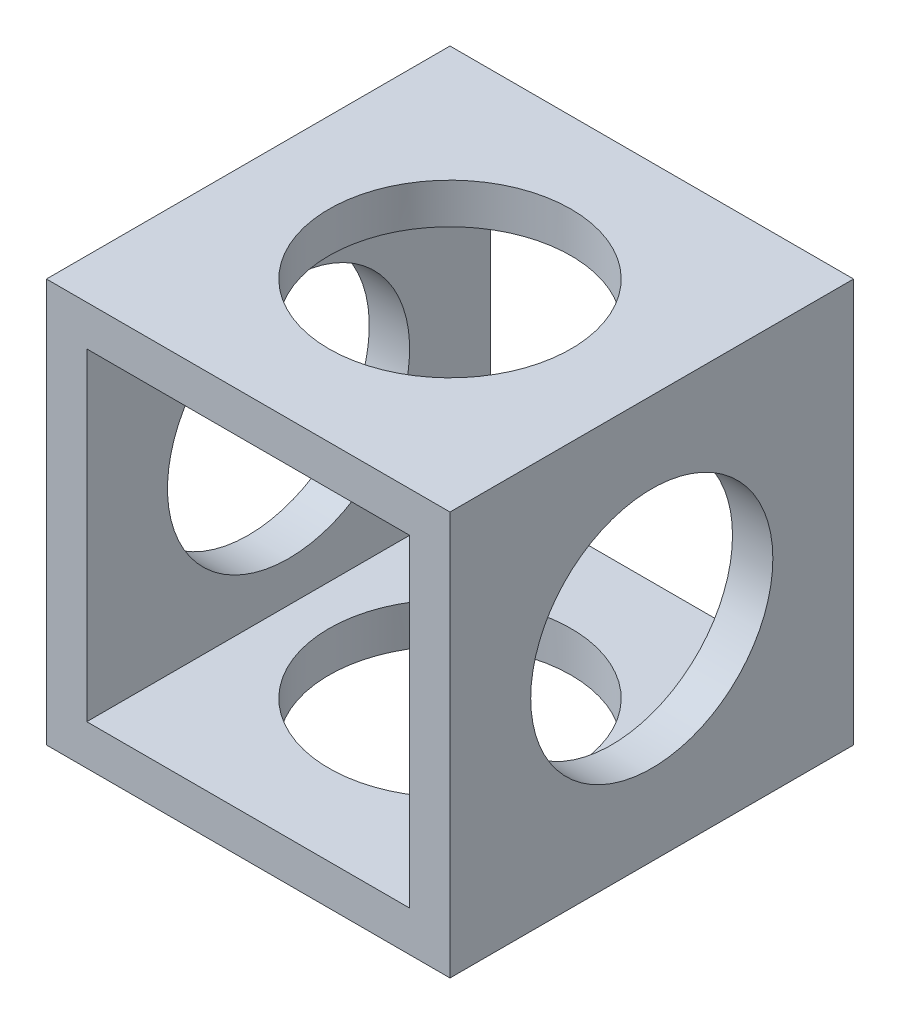
ISO-10303-21;
HEADER;
FILE_DESCRIPTION(('STEP AP214'),'2;1');
FILE_NAME('part.step','',(''),(''),'','','');
FILE_SCHEMA(('AUTOMOTIVE_DESIGN { 1 0 10303 214 1 1 1 1 }'));
ENDSEC;
DATA;
#1=APPLICATION_CONTEXT('core data for automotive mechanical design processes');
#2=APPLICATION_PROTOCOL_DEFINITION('international standard','automotive_design',2000,#1);
#3=PRODUCT_CONTEXT('',#1,'mechanical');
#4=PRODUCT('Part','Part','',(#3));
#5=PRODUCT_RELATED_PRODUCT_CATEGORY('part','',(#4));
#6=PRODUCT_DEFINITION_FORMATION('','',#4);
#7=PRODUCT_DEFINITION_CONTEXT('part definition',#1,'design');
#8=PRODUCT_DEFINITION('design','',#6,#7);
#9=PRODUCT_DEFINITION_SHAPE('','',#8);
#10=(LENGTH_UNIT() NAMED_UNIT(*) SI_UNIT(.MILLI.,.METRE.));
#11=(NAMED_UNIT(*) PLANE_ANGLE_UNIT() SI_UNIT($,.RADIAN.));
#12=(NAMED_UNIT(*) SI_UNIT($,.STERADIAN.) SOLID_ANGLE_UNIT());
#13=UNCERTAINTY_MEASURE_WITH_UNIT(LENGTH_MEASURE(1.E-05),#10,'distance_accuracy_value','');
#14=(GEOMETRIC_REPRESENTATION_CONTEXT(3) GLOBAL_UNCERTAINTY_ASSIGNED_CONTEXT((#13)) GLOBAL_UNIT_ASSIGNED_CONTEXT((#10,
#11,#12)) REPRESENTATION_CONTEXT('',''));
#15=CARTESIAN_POINT('',(0.,0.,0.));
#16=DIRECTION('',(0.,0.,1.));
#17=DIRECTION('',(1.,0.,0.));
#18=AXIS2_PLACEMENT_3D('',#15,#16,#17);
#19=CARTESIAN_POINT('',(25.,-25.,-50.));
#20=DIRECTION('',(1.,0.,0.));
#21=DIRECTION('',(0.,0.,-1.));
#22=AXIS2_PLACEMENT_3D('',#19,#20,#21);
#23=PLANE('',#22);
#24=CARTESIAN_POINT('',(25.,0.,-25.));
#25=DIRECTION('',(1.,0.,0.));
#26=DIRECTION('',(0.,0.,-1.));
#27=AXIS2_PLACEMENT_3D('',#24,#25,#26);
#28=CIRCLE('',#27,15.);
#29=CARTESIAN_POINT('',(25.,0.,-40.));
#30=VERTEX_POINT('',#29);
#31=EDGE_CURVE('E184',#30,#30,#28,.T.);
#32=ORIENTED_EDGE('',*,*,#31,.F.);
#33=EDGE_LOOP('',(#32));
#34=FACE_BOUND('',#33,.T.);
#35=DIRECTION('',(0.,1.,0.));
#36=VECTOR('',#35,1.);
#37=CARTESIAN_POINT('',(25.,-25.,0.));
#38=LINE('',#37,#36);
#39=CARTESIAN_POINT('',(25.,-25.,0.));
#40=VERTEX_POINT('',#39);
#41=CARTESIAN_POINT('',(25.,25.,0.));
#42=VERTEX_POINT('',#41);
#43=EDGE_CURVE('E134',#40,#42,#38,.T.);
#44=ORIENTED_EDGE('',*,*,#43,.F.);
#45=DIRECTION('',(0.,0.,1.));
#46=VECTOR('',#45,1.);
#47=CARTESIAN_POINT('',(25.,-25.,-50.));
#48=LINE('',#47,#46);
#49=CARTESIAN_POINT('',(25.,-25.,-50.));
#50=VERTEX_POINT('',#49);
#51=EDGE_CURVE('E11',#50,#40,#48,.T.);
#52=ORIENTED_EDGE('',*,*,#51,.F.);
#53=DIRECTION('',(0.,1.,0.));
#54=VECTOR('',#53,1.);
#55=CARTESIAN_POINT('',(25.,-25.,-50.));
#56=LINE('',#55,#54);
#57=CARTESIAN_POINT('',(25.,25.,-50.));
#58=VERTEX_POINT('',#57);
#59=EDGE_CURVE('E138',#50,#58,#56,.T.);
#60=ORIENTED_EDGE('',*,*,#59,.T.);
#61=DIRECTION('',(0.,0.,1.));
#62=VECTOR('',#61,1.);
#63=CARTESIAN_POINT('',(25.,25.,-50.));
#64=LINE('',#63,#62);
#65=EDGE_CURVE('E151',#58,#42,#64,.T.);
#66=ORIENTED_EDGE('',*,*,#65,.T.);
#67=EDGE_LOOP('',(#44,#52,#60,#66));
#68=FACE_BOUND('',#67,.T.);
#69=ADVANCED_FACE('F33',(#34,#68),#23,.T.);
#70=CARTESIAN_POINT('',(-25.,-25.,-50.));
#71=DIRECTION('',(0.,-1.,0.));
#72=DIRECTION('',(0.,0.,-1.));
#73=AXIS2_PLACEMENT_3D('',#70,#71,#72);
#74=PLANE('',#73);
#75=CARTESIAN_POINT('',(0.,-25.,-25.));
#76=DIRECTION('',(0.,-1.,0.));
#77=DIRECTION('',(0.,0.,-1.));
#78=AXIS2_PLACEMENT_3D('',#75,#76,#77);
#79=CIRCLE('',#78,15.);
#80=CARTESIAN_POINT('',(0.,-25.,-40.));
#81=VERTEX_POINT('',#80);
#82=EDGE_CURVE('E167',#81,#81,#79,.F.);
#83=ORIENTED_EDGE('',*,*,#82,.T.);
#84=EDGE_LOOP('',(#83));
#85=FACE_BOUND('',#84,.T.);
#86=DIRECTION('',(1.,0.,0.));
#87=VECTOR('',#86,1.);
#88=CARTESIAN_POINT('',(-25.,-25.,0.));
#89=LINE('',#88,#87);
#90=CARTESIAN_POINT('',(-25.,-25.,0.));
#91=VERTEX_POINT('',#90);
#92=EDGE_CURVE('E142',#91,#40,#89,.T.);
#93=ORIENTED_EDGE('',*,*,#92,.F.);
#94=DIRECTION('',(0.,0.,1.));
#95=VECTOR('',#94,1.);
#96=CARTESIAN_POINT('',(-25.,-25.,-50.));
#97=LINE('',#96,#95);
#98=CARTESIAN_POINT('',(-25.,-25.,-50.));
#99=VERTEX_POINT('',#98);
#100=EDGE_CURVE('E41',#99,#91,#97,.T.);
#101=ORIENTED_EDGE('',*,*,#100,.F.);
#102=DIRECTION('',(1.,0.,0.));
#103=VECTOR('',#102,1.);
#104=CARTESIAN_POINT('',(-25.,-25.,-50.));
#105=LINE('',#104,#103);
#106=EDGE_CURVE('E148',#99,#50,#105,.T.);
#107=ORIENTED_EDGE('',*,*,#106,.T.);
#108=ORIENTED_EDGE('',*,*,#51,.T.);
#109=EDGE_LOOP('',(#93,#101,#107,#108));
#110=FACE_BOUND('',#109,.T.);
#111=ADVANCED_FACE('F193',(#85,#110),#74,.T.);
#112=CARTESIAN_POINT('',(-25.,-25.,-50.));
#113=DIRECTION('',(-1.,0.,0.));
#114=DIRECTION('',(0.,-1.,0.));
#115=AXIS2_PLACEMENT_3D('',#112,#113,#114);
#116=PLANE('',#115);
#117=CARTESIAN_POINT('',(-25.,0.,-25.));
#118=DIRECTION('',(-1.,0.,0.));
#119=DIRECTION('',(0.,-1.,0.));
#120=AXIS2_PLACEMENT_3D('',#117,#118,#119);
#121=CIRCLE('',#120,15.);
#122=CARTESIAN_POINT('',(-25.,-15.,-25.));
#123=VERTEX_POINT('',#122);
#124=EDGE_CURVE('E181',#123,#123,#121,.F.);
#125=ORIENTED_EDGE('',*,*,#124,.T.);
#126=EDGE_LOOP('',(#125));
#127=FACE_BOUND('',#126,.T.);
#128=DIRECTION('',(0.,-1.,0.));
#129=VECTOR('',#128,1.);
#130=CARTESIAN_POINT('',(-25.,-25.,0.));
#131=LINE('',#130,#129);
#132=CARTESIAN_POINT('',(-25.,25.,0.));
#133=VERTEX_POINT('',#132);
#134=EDGE_CURVE('E157',#133,#91,#131,.T.);
#135=ORIENTED_EDGE('',*,*,#134,.F.);
#136=DIRECTION('',(0.,0.,1.));
#137=VECTOR('',#136,1.);
#138=CARTESIAN_POINT('',(-25.,25.,-50.));
#139=LINE('',#138,#137);
#140=CARTESIAN_POINT('',(-25.,25.,-50.));
#141=VERTEX_POINT('',#140);
#142=EDGE_CURVE('E163',#141,#133,#139,.T.);
#143=ORIENTED_EDGE('',*,*,#142,.F.);
#144=DIRECTION('',(0.,-1.,0.));
#145=VECTOR('',#144,1.);
#146=CARTESIAN_POINT('',(-25.,-25.,-50.));
#147=LINE('',#146,#145);
#148=EDGE_CURVE('E145',#141,#99,#147,.T.);
#149=ORIENTED_EDGE('',*,*,#148,.T.);
#150=ORIENTED_EDGE('',*,*,#100,.T.);
#151=EDGE_LOOP('',(#135,#143,#149,#150));
#152=FACE_BOUND('',#151,.T.);
#153=ADVANCED_FACE('F208',(#127,#152),#116,.T.);
#154=CARTESIAN_POINT('',(-25.,25.,-50.));
#155=DIRECTION('',(0.,1.,0.));
#156=DIRECTION('',(0.,0.,1.));
#157=AXIS2_PLACEMENT_3D('',#154,#155,#156);
#158=PLANE('',#157);
#159=CARTESIAN_POINT('',(0.,25.,-25.));
#160=DIRECTION('',(0.,1.,0.));
#161=DIRECTION('',(0.,0.,1.));
#162=AXIS2_PLACEMENT_3D('',#159,#160,#161);
#163=CIRCLE('',#162,15.);
#164=CARTESIAN_POINT('',(0.,25.,-10.));
#165=VERTEX_POINT('',#164);
#166=EDGE_CURVE('E172',#165,#165,#163,.T.);
#167=ORIENTED_EDGE('',*,*,#166,.F.);
#168=EDGE_LOOP('',(#167));
#169=FACE_BOUND('',#168,.T.);
#170=DIRECTION('',(-1.,0.,0.));
#171=VECTOR('',#170,1.);
#172=CARTESIAN_POINT('',(-25.,25.,0.));
#173=LINE('',#172,#171);
#174=EDGE_CURVE('E154',#42,#133,#173,.T.);
#175=ORIENTED_EDGE('',*,*,#174,.F.);
#176=ORIENTED_EDGE('',*,*,#65,.F.);
#177=DIRECTION('',(-1.,0.,0.));
#178=VECTOR('',#177,1.);
#179=CARTESIAN_POINT('',(-25.,25.,-50.));
#180=LINE('',#179,#178);
#181=EDGE_CURVE('E141',#58,#141,#180,.T.);
#182=ORIENTED_EDGE('',*,*,#181,.T.);
#183=ORIENTED_EDGE('',*,*,#142,.T.);
#184=EDGE_LOOP('',(#175,#176,#182,#183));
#185=FACE_BOUND('',#184,.T.);
#186=ADVANCED_FACE('F206',(#169,#185),#158,.T.);
#187=CARTESIAN_POINT('',(0.,0.,-50.));
#188=DIRECTION('',(0.,0.,-1.));
#189=DIRECTION('',(-1.,0.,0.));
#190=AXIS2_PLACEMENT_3D('',#187,#188,#189);
#191=PLANE('',#190);
#192=DIRECTION('',(0.,1.,0.));
#193=VECTOR('',#192,1.);
#194=CARTESIAN_POINT('',(20.0000000000001,-20.0000000000003,-50.));
#195=LINE('',#194,#193);
#196=CARTESIAN_POINT('',(20.0000000000001,-20.0000000000003,-50.));
#197=VERTEX_POINT('',#196);
#198=CARTESIAN_POINT('',(20.0000000000001,20.0000000000003,-50.));
#199=VERTEX_POINT('',#198);
#200=EDGE_CURVE('E100',#197,#199,#195,.T.);
#201=ORIENTED_EDGE('',*,*,#200,.T.);
#202=DIRECTION('',(-1.,0.,0.));
#203=VECTOR('',#202,1.);
#204=CARTESIAN_POINT('',(-20.0000000000001,20.0000000000003,-50.));
#205=LINE('',#204,#203);
#206=CARTESIAN_POINT('',(-20.0000000000001,20.0000000000003,-50.));
#207=VERTEX_POINT('',#206);
#208=EDGE_CURVE('E109',#199,#207,#205,.T.);
#209=ORIENTED_EDGE('',*,*,#208,.T.);
#210=DIRECTION('',(0.,-1.,0.));
#211=VECTOR('',#210,1.);
#212=CARTESIAN_POINT('',(-20.0000000000001,-20.0000000000003,-50.));
#213=LINE('',#212,#211);
#214=CARTESIAN_POINT('',(-20.0000000000001,-20.0000000000003,-50.));
#215=VERTEX_POINT('',#214);
#216=EDGE_CURVE('E49',#207,#215,#213,.T.);
#217=ORIENTED_EDGE('',*,*,#216,.T.);
#218=DIRECTION('',(1.,0.,0.));
#219=VECTOR('',#218,1.);
#220=CARTESIAN_POINT('',(-20.0000000000001,-20.0000000000003,-50.));
#221=LINE('',#220,#219);
#222=EDGE_CURVE('E106',#215,#197,#221,.T.);
#223=ORIENTED_EDGE('',*,*,#222,.T.);
#224=EDGE_LOOP('',(#201,#209,#217,#223));
#225=FACE_BOUND('',#224,.T.);
#226=ORIENTED_EDGE('',*,*,#59,.F.);
#227=ORIENTED_EDGE('',*,*,#106,.F.);
#228=ORIENTED_EDGE('',*,*,#148,.F.);
#229=ORIENTED_EDGE('',*,*,#181,.F.);
#230=EDGE_LOOP('',(#226,#227,#228,#229));
#231=FACE_BOUND('',#230,.T.);
#232=ADVANCED_FACE('F113',(#225,#231),#191,.T.);
#233=CARTESIAN_POINT('',(0.,0.,0.));
#234=DIRECTION('',(0.,0.,-1.));
#235=DIRECTION('',(-1.,0.,0.));
#236=AXIS2_PLACEMENT_3D('',#233,#234,#235);
#237=PLANE('',#236);
#238=DIRECTION('',(-1.,0.,0.));
#239=VECTOR('',#238,1.);
#240=CARTESIAN_POINT('',(-20.0000000000001,20.0000000000003,0.));
#241=LINE('',#240,#239);
#242=CARTESIAN_POINT('',(20.0000000000001,20.0000000000003,0.));
#243=VERTEX_POINT('',#242);
#244=CARTESIAN_POINT('',(-20.0000000000001,20.0000000000003,0.));
#245=VERTEX_POINT('',#244);
#246=EDGE_CURVE('E128',#243,#245,#241,.T.);
#247=ORIENTED_EDGE('',*,*,#246,.F.);
#248=DIRECTION('',(0.,1.,0.));
#249=VECTOR('',#248,1.);
#250=CARTESIAN_POINT('',(20.0000000000001,-20.0000000000003,0.));
#251=LINE('',#250,#249);
#252=CARTESIAN_POINT('',(20.0000000000001,-20.0000000000003,0.));
#253=VERTEX_POINT('',#252);
#254=EDGE_CURVE('E57',#253,#243,#251,.T.);
#255=ORIENTED_EDGE('',*,*,#254,.F.);
#256=DIRECTION('',(1.,0.,0.));
#257=VECTOR('',#256,1.);
#258=CARTESIAN_POINT('',(-20.0000000000001,-20.0000000000003,0.));
#259=LINE('',#258,#257);
#260=CARTESIAN_POINT('',(-20.0000000000001,-20.0000000000003,0.));
#261=VERTEX_POINT('',#260);
#262=EDGE_CURVE('E116',#261,#253,#259,.T.);
#263=ORIENTED_EDGE('',*,*,#262,.F.);
#264=DIRECTION('',(0.,-1.,0.));
#265=VECTOR('',#264,1.);
#266=CARTESIAN_POINT('',(-20.0000000000001,-20.0000000000003,0.));
#267=LINE('',#266,#265);
#268=EDGE_CURVE('E119',#245,#261,#267,.T.);
#269=ORIENTED_EDGE('',*,*,#268,.F.);
#270=EDGE_LOOP('',(#247,#255,#263,#269));
#271=FACE_BOUND('',#270,.T.);
#272=ORIENTED_EDGE('',*,*,#43,.T.);
#273=ORIENTED_EDGE('',*,*,#174,.T.);
#274=ORIENTED_EDGE('',*,*,#134,.T.);
#275=ORIENTED_EDGE('',*,*,#92,.T.);
#276=EDGE_LOOP('',(#272,#273,#274,#275));
#277=FACE_BOUND('',#276,.T.);
#278=ADVANCED_FACE('F199',(#271,#277),#237,.F.);
#279=CARTESIAN_POINT('',(20.0000000000001,-20.0000000000003,-50.));
#280=DIRECTION('',(1.,0.,0.));
#281=DIRECTION('',(0.,1.,0.));
#282=AXIS2_PLACEMENT_3D('',#279,#280,#281);
#283=PLANE('',#282);
#284=CARTESIAN_POINT('',(20.,0.,-25.));
#285=DIRECTION('',(1.,0.,0.));
#286=DIRECTION('',(0.,1.,0.));
#287=AXIS2_PLACEMENT_3D('',#284,#285,#286);
#288=CIRCLE('',#287,15.);
#289=CARTESIAN_POINT('',(20.,15.,-25.));
#290=VERTEX_POINT('',#289);
#291=EDGE_CURVE('E176',#290,#290,#288,.T.);
#292=ORIENTED_EDGE('',*,*,#291,.T.);
#293=EDGE_LOOP('',(#292));
#294=FACE_BOUND('',#293,.T.);
#295=ORIENTED_EDGE('',*,*,#254,.T.);
#296=DIRECTION('',(0.,0.,1.));
#297=VECTOR('',#296,1.);
#298=CARTESIAN_POINT('',(20.0000000000001,20.0000000000003,-50.));
#299=LINE('',#298,#297);
#300=EDGE_CURVE('E96',#199,#243,#299,.T.);
#301=ORIENTED_EDGE('',*,*,#300,.F.);
#302=ORIENTED_EDGE('',*,*,#200,.F.);
#303=DIRECTION('',(0.,0.,1.));
#304=VECTOR('',#303,1.);
#305=CARTESIAN_POINT('',(20.0000000000001,-20.0000000000003,-50.));
#306=LINE('',#305,#304);
#307=EDGE_CURVE('E132',#197,#253,#306,.T.);
#308=ORIENTED_EDGE('',*,*,#307,.T.);
#309=EDGE_LOOP('',(#295,#301,#302,#308));
#310=FACE_BOUND('',#309,.T.);
#311=ADVANCED_FACE('F98',(#294,#310),#283,.F.);
#312=CARTESIAN_POINT('',(-20.0000000000001,-20.0000000000003,-50.));
#313=DIRECTION('',(0.,-1.,0.));
#314=DIRECTION('',(1.,0.,0.));
#315=AXIS2_PLACEMENT_3D('',#312,#313,#314);
#316=PLANE('',#315);
#317=CARTESIAN_POINT('',(0.,-20.0000000000003,-25.));
#318=DIRECTION('',(0.,-1.,0.));
#319=DIRECTION('',(1.,0.,0.));
#320=AXIS2_PLACEMENT_3D('',#317,#318,#319);
#321=CIRCLE('',#320,15.);
#322=CARTESIAN_POINT('',(15.,-20.0000000000003,-25.));
#323=VERTEX_POINT('',#322);
#324=EDGE_CURVE('E122',#323,#323,#321,.T.);
#325=ORIENTED_EDGE('',*,*,#324,.T.);
#326=EDGE_LOOP('',(#325));
#327=FACE_BOUND('',#326,.T.);
#328=ORIENTED_EDGE('',*,*,#262,.T.);
#329=ORIENTED_EDGE('',*,*,#307,.F.);
#330=ORIENTED_EDGE('',*,*,#222,.F.);
#331=DIRECTION('',(0.,0.,1.));
#332=VECTOR('',#331,1.);
#333=CARTESIAN_POINT('',(-20.0000000000001,-20.0000000000003,-50.));
#334=LINE('',#333,#332);
#335=EDGE_CURVE('E135',#215,#261,#334,.T.);
#336=ORIENTED_EDGE('',*,*,#335,.T.);
#337=EDGE_LOOP('',(#328,#329,#330,#336));
#338=FACE_BOUND('',#337,.T.);
#339=ADVANCED_FACE('F226',(#327,#338),#316,.F.);
#340=CARTESIAN_POINT('',(-20.0000000000001,-20.0000000000003,-50.));
#341=DIRECTION('',(-1.,0.,0.));
#342=DIRECTION('',(0.,-1.,0.));
#343=AXIS2_PLACEMENT_3D('',#340,#341,#342);
#344=PLANE('',#343);
#345=CARTESIAN_POINT('',(-20.0000000000001,0.,-25.));
#346=DIRECTION('',(-1.,0.,0.));
#347=DIRECTION('',(0.,-1.,0.));
#348=AXIS2_PLACEMENT_3D('',#345,#346,#347);
#349=CIRCLE('',#348,15.);
#350=CARTESIAN_POINT('',(-20.0000000000001,-15.,-25.));
#351=VERTEX_POINT('',#350);
#352=EDGE_CURVE('E36',#351,#351,#349,.T.);
#353=ORIENTED_EDGE('',*,*,#352,.T.);
#354=EDGE_LOOP('',(#353));
#355=FACE_BOUND('',#354,.T.);
#356=ORIENTED_EDGE('',*,*,#268,.T.);
#357=ORIENTED_EDGE('',*,*,#335,.F.);
#358=ORIENTED_EDGE('',*,*,#216,.F.);
#359=DIRECTION('',(0.,0.,1.));
#360=VECTOR('',#359,1.);
#361=CARTESIAN_POINT('',(-20.0000000000001,20.0000000000003,-50.));
#362=LINE('',#361,#360);
#363=EDGE_CURVE('E105',#207,#245,#362,.T.);
#364=ORIENTED_EDGE('',*,*,#363,.T.);
#365=EDGE_LOOP('',(#356,#357,#358,#364));
#366=FACE_BOUND('',#365,.T.);
#367=ADVANCED_FACE('F231',(#355,#366),#344,.F.);
#368=CARTESIAN_POINT('',(-20.0000000000001,20.0000000000003,-50.));
#369=DIRECTION('',(0.,1.,0.));
#370=DIRECTION('',(-1.,0.,0.));
#371=AXIS2_PLACEMENT_3D('',#368,#369,#370);
#372=PLANE('',#371);
#373=CARTESIAN_POINT('',(0.,20.0000000000003,-25.));
#374=DIRECTION('',(0.,1.,0.));
#375=DIRECTION('',(-1.,0.,0.));
#376=AXIS2_PLACEMENT_3D('',#373,#374,#375);
#377=CIRCLE('',#376,15.);
#378=CARTESIAN_POINT('',(-15.,20.0000000000003,-25.));
#379=VERTEX_POINT('',#378);
#380=EDGE_CURVE('E165',#379,#379,#377,.T.);
#381=ORIENTED_EDGE('',*,*,#380,.T.);
#382=EDGE_LOOP('',(#381));
#383=FACE_BOUND('',#382,.T.);
#384=ORIENTED_EDGE('',*,*,#246,.T.);
#385=ORIENTED_EDGE('',*,*,#363,.F.);
#386=ORIENTED_EDGE('',*,*,#208,.F.);
#387=ORIENTED_EDGE('',*,*,#300,.T.);
#388=EDGE_LOOP('',(#384,#385,#386,#387));
#389=FACE_BOUND('',#388,.T.);
#390=ADVANCED_FACE('F110',(#383,#389),#372,.F.);
#391=CARTESIAN_POINT('',(0.,-67.4264068711929,-25.));
#392=DIRECTION('',(0.,1.,0.));
#393=DIRECTION('',(0.,0.,1.));
#394=AXIS2_PLACEMENT_3D('',#391,#392,#393);
#395=CYLINDRICAL_SURFACE('',#394,15.);
#396=ORIENTED_EDGE('',*,*,#166,.T.);
#397=EDGE_LOOP('',(#396));
#398=FACE_BOUND('',#397,.T.);
#399=ORIENTED_EDGE('',*,*,#380,.F.);
#400=EDGE_LOOP('',(#399));
#401=FACE_BOUND('',#400,.T.);
#402=ADVANCED_FACE('F230',(#398,#401),#395,.F.);
#403=ORIENTED_EDGE('',*,*,#82,.F.);
#404=EDGE_LOOP('',(#403));
#405=FACE_BOUND('',#404,.T.);
#406=ORIENTED_EDGE('',*,*,#324,.F.);
#407=EDGE_LOOP('',(#406));
#408=FACE_BOUND('',#407,.T.);
#409=ADVANCED_FACE('F238',(#405,#408),#395,.F.);
#410=CARTESIAN_POINT('',(-67.4264068711929,0.,-25.));
#411=DIRECTION('',(1.,0.,0.));
#412=DIRECTION('',(0.,0.,-1.));
#413=AXIS2_PLACEMENT_3D('',#410,#411,#412);
#414=CYLINDRICAL_SURFACE('',#413,15.);
#415=ORIENTED_EDGE('',*,*,#124,.F.);
#416=EDGE_LOOP('',(#415));
#417=FACE_BOUND('',#416,.T.);
#418=ORIENTED_EDGE('',*,*,#352,.F.);
#419=EDGE_LOOP('',(#418));
#420=FACE_BOUND('',#419,.T.);
#421=ADVANCED_FACE('F241',(#417,#420),#414,.F.);
#422=ORIENTED_EDGE('',*,*,#31,.T.);
#423=EDGE_LOOP('',(#422));
#424=FACE_BOUND('',#423,.T.);
#425=ORIENTED_EDGE('',*,*,#291,.F.);
#426=EDGE_LOOP('',(#425));
#427=FACE_BOUND('',#426,.T.);
#428=ADVANCED_FACE('F188',(#424,#427),#414,.F.);
#429=CLOSED_SHELL('',(#69,#111,#153,#186,#232,#278,#311,#339,#367,#390,#402,#409,#421,#428));
#430=MANIFOLD_SOLID_BREP('B2',#429);
#431=ADVANCED_BREP_SHAPE_REPRESENTATION('',(#18,#430),#14);
#432=SHAPE_DEFINITION_REPRESENTATION(#9,#431);
ENDSEC;
END-ISO-10303-21;
